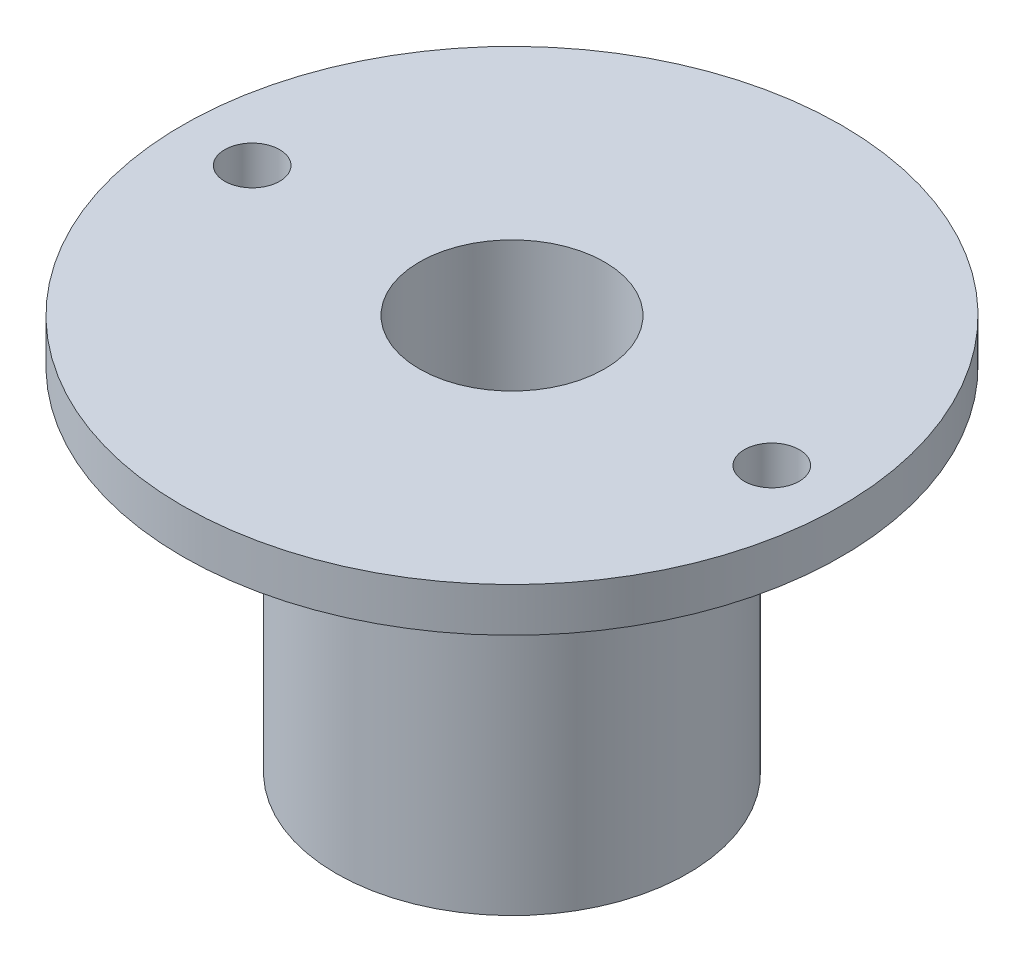
ISO-10303-21;
HEADER;
FILE_DESCRIPTION(('STEP AP214'),'2;1');
FILE_NAME('part.step','',(''),(''),'','','');
FILE_SCHEMA(('AUTOMOTIVE_DESIGN { 1 0 10303 214 1 1 1 1 }'));
ENDSEC;
DATA;
#1=APPLICATION_CONTEXT('core data for automotive mechanical design processes');
#2=APPLICATION_PROTOCOL_DEFINITION('international standard','automotive_design',2000,#1);
#3=PRODUCT_CONTEXT('',#1,'mechanical');
#4=PRODUCT('Part','Part','',(#3));
#5=PRODUCT_RELATED_PRODUCT_CATEGORY('part','',(#4));
#6=PRODUCT_DEFINITION_FORMATION('','',#4);
#7=PRODUCT_DEFINITION_CONTEXT('part definition',#1,'design');
#8=PRODUCT_DEFINITION('design','',#6,#7);
#9=PRODUCT_DEFINITION_SHAPE('','',#8);
#10=(LENGTH_UNIT() NAMED_UNIT(*) SI_UNIT(.MILLI.,.METRE.));
#11=(NAMED_UNIT(*) PLANE_ANGLE_UNIT() SI_UNIT($,.RADIAN.));
#12=(NAMED_UNIT(*) SI_UNIT($,.STERADIAN.) SOLID_ANGLE_UNIT());
#13=UNCERTAINTY_MEASURE_WITH_UNIT(LENGTH_MEASURE(1.E-05),#10,'distance_accuracy_value','');
#14=(GEOMETRIC_REPRESENTATION_CONTEXT(3) GLOBAL_UNCERTAINTY_ASSIGNED_CONTEXT((#13)) GLOBAL_UNIT_ASSIGNED_CONTEXT((#10,
#11,#12)) REPRESENTATION_CONTEXT('',''));
#15=CARTESIAN_POINT('',(0.,0.,0.));
#16=DIRECTION('',(0.,0.,1.));
#17=DIRECTION('',(1.,0.,0.));
#18=AXIS2_PLACEMENT_3D('',#15,#16,#17);
#19=CARTESIAN_POINT('',(0.,-2.,0.));
#20=DIRECTION('',(0.,1.,0.));
#21=DIRECTION('',(0.,0.,1.));
#22=AXIS2_PLACEMENT_3D('',#19,#20,#21);
#23=PLANE('',#22);
#24=CARTESIAN_POINT('',(-11.825,-2.,0.));
#25=DIRECTION('',(0.,1.,0.));
#26=DIRECTION('',(0.,0.,1.));
#27=AXIS2_PLACEMENT_3D('',#24,#25,#26);
#28=CIRCLE('',#27,1.25);
#29=CARTESIAN_POINT('',(-11.825,-2.,1.25000000000002));
#30=VERTEX_POINT('',#29);
#31=EDGE_CURVE('E67',#30,#30,#28,.T.);
#32=ORIENTED_EDGE('',*,*,#31,.T.);
#33=EDGE_LOOP('',(#32));
#34=FACE_BOUND('',#33,.T.);
#35=CARTESIAN_POINT('',(11.825,-2.,0.));
#36=DIRECTION('',(0.,1.,0.));
#37=DIRECTION('',(0.,0.,1.));
#38=AXIS2_PLACEMENT_3D('',#35,#36,#37);
#39=CIRCLE('',#38,1.25);
#40=CARTESIAN_POINT('',(11.825,-2.,1.25000000000001));
#41=VERTEX_POINT('',#40);
#42=EDGE_CURVE('E61',#41,#41,#39,.T.);
#43=ORIENTED_EDGE('',*,*,#42,.T.);
#44=EDGE_LOOP('',(#43));
#45=FACE_BOUND('',#44,.T.);
#46=CARTESIAN_POINT('',(0.,-2.,0.));
#47=DIRECTION('',(0.,1.,0.));
#48=DIRECTION('',(0.,0.,1.));
#49=AXIS2_PLACEMENT_3D('',#46,#47,#48);
#50=CIRCLE('',#49,15.);
#51=CARTESIAN_POINT('',(0.,-2.,15.));
#52=VERTEX_POINT('',#51);
#53=EDGE_CURVE('E42',#52,#52,#50,.T.);
#54=ORIENTED_EDGE('',*,*,#53,.F.);
#55=EDGE_LOOP('',(#54));
#56=FACE_BOUND('',#55,.T.);
#57=CARTESIAN_POINT('',(0.,-2.,0.));
#58=DIRECTION('',(0.,1.,0.));
#59=DIRECTION('',(0.,0.,1.));
#60=AXIS2_PLACEMENT_3D('',#57,#58,#59);
#61=CIRCLE('',#60,8.);
#62=CARTESIAN_POINT('',(0.,-2.,8.));
#63=VERTEX_POINT('',#62);
#64=EDGE_CURVE('E10',#63,#63,#61,.F.);
#65=ORIENTED_EDGE('',*,*,#64,.F.);
#66=EDGE_LOOP('',(#65));
#67=FACE_BOUND('',#66,.T.);
#68=ADVANCED_FACE('F35',(#34,#45,#56,#67),#23,.F.);
#69=CARTESIAN_POINT('',(0.,-2.,0.));
#70=DIRECTION('',(0.,1.,0.));
#71=DIRECTION('',(0.,0.,1.));
#72=AXIS2_PLACEMENT_3D('',#69,#70,#71);
#73=CYLINDRICAL_SURFACE('',#72,15.);
#74=ORIENTED_EDGE('',*,*,#53,.T.);
#75=EDGE_LOOP('',(#74));
#76=FACE_BOUND('',#75,.T.);
#77=CARTESIAN_POINT('',(0.,0.,0.));
#78=DIRECTION('',(0.,1.,0.));
#79=DIRECTION('',(0.,0.,1.));
#80=AXIS2_PLACEMENT_3D('',#77,#78,#79);
#81=CIRCLE('',#80,15.);
#82=CARTESIAN_POINT('',(0.,0.,15.));
#83=VERTEX_POINT('',#82);
#84=EDGE_CURVE('E46',#83,#83,#81,.T.);
#85=ORIENTED_EDGE('',*,*,#84,.F.);
#86=EDGE_LOOP('',(#85));
#87=FACE_BOUND('',#86,.T.);
#88=ADVANCED_FACE('F37',(#76,#87),#73,.T.);
#89=CARTESIAN_POINT('',(0.,0.,0.));
#90=DIRECTION('',(0.,1.,0.));
#91=DIRECTION('',(0.,0.,1.));
#92=AXIS2_PLACEMENT_3D('',#89,#90,#91);
#93=PLANE('',#92);
#94=CARTESIAN_POINT('',(-11.825,0.,0.));
#95=DIRECTION('',(0.,1.,0.));
#96=DIRECTION('',(0.,0.,1.));
#97=AXIS2_PLACEMENT_3D('',#94,#95,#96);
#98=CIRCLE('',#97,1.25);
#99=CARTESIAN_POINT('',(-11.825,0.,1.25000000000002));
#100=VERTEX_POINT('',#99);
#101=EDGE_CURVE('E70',#100,#100,#98,.T.);
#102=ORIENTED_EDGE('',*,*,#101,.F.);
#103=EDGE_LOOP('',(#102));
#104=FACE_BOUND('',#103,.T.);
#105=CARTESIAN_POINT('',(11.825,0.,0.));
#106=DIRECTION('',(0.,1.,0.));
#107=DIRECTION('',(0.,0.,1.));
#108=AXIS2_PLACEMENT_3D('',#105,#106,#107);
#109=CIRCLE('',#108,1.25);
#110=CARTESIAN_POINT('',(11.825,0.,1.25000000000001));
#111=VERTEX_POINT('',#110);
#112=EDGE_CURVE('E64',#111,#111,#109,.T.);
#113=ORIENTED_EDGE('',*,*,#112,.F.);
#114=EDGE_LOOP('',(#113));
#115=FACE_BOUND('',#114,.T.);
#116=CARTESIAN_POINT('',(0.,0.,0.));
#117=DIRECTION('',(0.,1.,0.));
#118=DIRECTION('',(0.,0.,1.));
#119=AXIS2_PLACEMENT_3D('',#116,#117,#118);
#120=CIRCLE('',#119,4.2164);
#121=CARTESIAN_POINT('',(0.,0.,4.2164));
#122=VERTEX_POINT('',#121);
#123=EDGE_CURVE('E55',#122,#122,#120,.T.);
#124=ORIENTED_EDGE('',*,*,#123,.F.);
#125=EDGE_LOOP('',(#124));
#126=FACE_BOUND('',#125,.T.);
#127=ORIENTED_EDGE('',*,*,#84,.T.);
#128=EDGE_LOOP('',(#127));
#129=FACE_BOUND('',#128,.T.);
#130=ADVANCED_FACE('F77',(#104,#115,#126,#129),#93,.T.);
#131=CARTESIAN_POINT('',(0.,-18.,0.));
#132=DIRECTION('',(0.,1.,0.));
#133=DIRECTION('',(0.,0.,1.));
#134=AXIS2_PLACEMENT_3D('',#131,#132,#133);
#135=CYLINDRICAL_SURFACE('',#134,8.);
#136=CARTESIAN_POINT('',(0.,-18.,0.));
#137=DIRECTION('',(0.,-1.,0.));
#138=DIRECTION('',(0.,0.,-1.));
#139=AXIS2_PLACEMENT_3D('',#136,#137,#138);
#140=CIRCLE('',#139,8.);
#141=CARTESIAN_POINT('',(0.,-18.,-8.));
#142=VERTEX_POINT('',#141);
#143=EDGE_CURVE('E51',#142,#142,#140,.T.);
#144=ORIENTED_EDGE('',*,*,#143,.F.);
#145=EDGE_LOOP('',(#144));
#146=FACE_BOUND('',#145,.T.);
#147=ORIENTED_EDGE('',*,*,#64,.T.);
#148=EDGE_LOOP('',(#147));
#149=FACE_BOUND('',#148,.T.);
#150=ADVANCED_FACE('F80',(#146,#149),#135,.T.);
#151=CARTESIAN_POINT('',(0.,-18.,0.));
#152=DIRECTION('',(0.,-1.,0.));
#153=DIRECTION('',(0.,0.,-1.));
#154=AXIS2_PLACEMENT_3D('',#151,#152,#153);
#155=PLANE('',#154);
#156=CARTESIAN_POINT('',(0.,-18.,0.));
#157=DIRECTION('',(0.,-1.,0.));
#158=DIRECTION('',(0.,0.,-1.));
#159=AXIS2_PLACEMENT_3D('',#156,#157,#158);
#160=CIRCLE('',#159,4.2164);
#161=CARTESIAN_POINT('',(0.,-18.,-4.2164));
#162=VERTEX_POINT('',#161);
#163=EDGE_CURVE('E58',#162,#162,#160,.T.);
#164=ORIENTED_EDGE('',*,*,#163,.F.);
#165=EDGE_LOOP('',(#164));
#166=FACE_BOUND('',#165,.T.);
#167=ORIENTED_EDGE('',*,*,#143,.T.);
#168=EDGE_LOOP('',(#167));
#169=FACE_BOUND('',#168,.T.);
#170=ADVANCED_FACE('F99',(#166,#169),#155,.T.);
#171=CARTESIAN_POINT('',(0.,-18.,0.));
#172=DIRECTION('',(0.,-1.,0.));
#173=DIRECTION('',(0.,0.,-1.));
#174=AXIS2_PLACEMENT_3D('',#171,#172,#173);
#175=CYLINDRICAL_SURFACE('',#174,4.2164);
#176=ORIENTED_EDGE('',*,*,#123,.T.);
#177=EDGE_LOOP('',(#176));
#178=FACE_BOUND('',#177,.T.);
#179=ORIENTED_EDGE('',*,*,#163,.T.);
#180=EDGE_LOOP('',(#179));
#181=FACE_BOUND('',#180,.T.);
#182=ADVANCED_FACE('F103',(#178,#181),#175,.F.);
#183=CARTESIAN_POINT('',(11.825,-10.,0.));
#184=DIRECTION('',(0.,1.,0.));
#185=DIRECTION('',(0.,0.,1.));
#186=AXIS2_PLACEMENT_3D('',#183,#184,#185);
#187=CYLINDRICAL_SURFACE('',#186,1.25);
#188=ORIENTED_EDGE('',*,*,#112,.T.);
#189=EDGE_LOOP('',(#188));
#190=FACE_BOUND('',#189,.T.);
#191=ORIENTED_EDGE('',*,*,#42,.F.);
#192=EDGE_LOOP('',(#191));
#193=FACE_BOUND('',#192,.T.);
#194=ADVANCED_FACE('F107',(#190,#193),#187,.F.);
#195=CARTESIAN_POINT('',(-11.825,-10.,0.));
#196=DIRECTION('',(0.,1.,0.));
#197=DIRECTION('',(0.,0.,1.));
#198=AXIS2_PLACEMENT_3D('',#195,#196,#197);
#199=CYLINDRICAL_SURFACE('',#198,1.25);
#200=ORIENTED_EDGE('',*,*,#101,.T.);
#201=EDGE_LOOP('',(#200));
#202=FACE_BOUND('',#201,.T.);
#203=ORIENTED_EDGE('',*,*,#31,.F.);
#204=EDGE_LOOP('',(#203));
#205=FACE_BOUND('',#204,.T.);
#206=ADVANCED_FACE('F74',(#202,#205),#199,.F.);
#207=CLOSED_SHELL('',(#68,#88,#130,#150,#170,#182,#194,#206));
#208=MANIFOLD_SOLID_BREP('B2',#207);
#209=ADVANCED_BREP_SHAPE_REPRESENTATION('',(#18,#208),#14);
#210=SHAPE_DEFINITION_REPRESENTATION(#9,#209);
ENDSEC;
END-ISO-10303-21;
